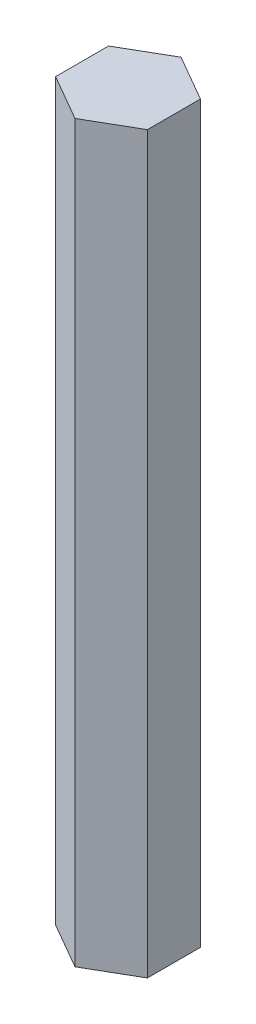
ISO-10303-21;
HEADER;
FILE_DESCRIPTION(('STEP AP214'),'2;1');
FILE_NAME('part.step','',(''),(''),'','','');
FILE_SCHEMA(('AUTOMOTIVE_DESIGN { 1 0 10303 214 1 1 1 1 }'));
ENDSEC;
DATA;
#1=APPLICATION_CONTEXT('core data for automotive mechanical design processes');
#2=APPLICATION_PROTOCOL_DEFINITION('international standard','automotive_design',2000,#1);
#3=PRODUCT_CONTEXT('',#1,'mechanical');
#4=PRODUCT('Part','Part','',(#3));
#5=PRODUCT_RELATED_PRODUCT_CATEGORY('part','',(#4));
#6=PRODUCT_DEFINITION_FORMATION('','',#4);
#7=PRODUCT_DEFINITION_CONTEXT('part definition',#1,'design');
#8=PRODUCT_DEFINITION('design','',#6,#7);
#9=PRODUCT_DEFINITION_SHAPE('','',#8);
#10=(LENGTH_UNIT() NAMED_UNIT(*) SI_UNIT(.MILLI.,.METRE.));
#11=(NAMED_UNIT(*) PLANE_ANGLE_UNIT() SI_UNIT($,.RADIAN.));
#12=(NAMED_UNIT(*) SI_UNIT($,.STERADIAN.) SOLID_ANGLE_UNIT());
#13=UNCERTAINTY_MEASURE_WITH_UNIT(LENGTH_MEASURE(1.E-05),#10,'distance_accuracy_value','');
#14=(GEOMETRIC_REPRESENTATION_CONTEXT(3) GLOBAL_UNCERTAINTY_ASSIGNED_CONTEXT((#13)) GLOBAL_UNIT_ASSIGNED_CONTEXT((#10,
#11,#12)) REPRESENTATION_CONTEXT('',''));
#15=CARTESIAN_POINT('',(0.,0.,0.));
#16=DIRECTION('',(0.,0.,1.));
#17=DIRECTION('',(1.,0.,0.));
#18=AXIS2_PLACEMENT_3D('',#15,#16,#17);
#19=CARTESIAN_POINT('',(4.99999999999996,80.,-2.88675134594818));
#20=DIRECTION('',(-0.499999999999995,0.,0.866025403784442));
#21=DIRECTION('',(0.866025403784442,0.,0.499999999999995));
#22=AXIS2_PLACEMENT_3D('',#19,#20,#21);
#23=PLANE('',#22);
#24=DIRECTION('',(-0.866025403784441,0.,-0.499999999999995));
#25=VECTOR('',#24,1.);
#26=CARTESIAN_POINT('',(4.99999999999996,0.,-2.88675134594818));
#27=LINE('',#26,#25);
#28=CARTESIAN_POINT('',(4.99999999999996,0.,-2.88675134594818));
#29=VERTEX_POINT('',#28);
#30=CARTESIAN_POINT('',(0.,0.,-5.77350269189625));
#31=VERTEX_POINT('',#30);
#32=EDGE_CURVE('E116',#29,#31,#27,.T.);
#33=ORIENTED_EDGE('',*,*,#32,.T.);
#34=DIRECTION('',(0.,-1.,0.));
#35=VECTOR('',#34,1.);
#36=CARTESIAN_POINT('',(0.,80.,-5.77350269189625));
#37=LINE('',#36,#35);
#38=CARTESIAN_POINT('',(0.,80.,-5.77350269189625));
#39=VERTEX_POINT('',#38);
#40=EDGE_CURVE('E11',#39,#31,#37,.T.);
#41=ORIENTED_EDGE('',*,*,#40,.F.);
#42=DIRECTION('',(-0.866025403784441,0.,-0.499999999999995));
#43=VECTOR('',#42,1.);
#44=CARTESIAN_POINT('',(4.99999999999996,80.,-2.88675134594818));
#45=LINE('',#44,#43);
#46=CARTESIAN_POINT('',(4.99999999999996,80.,-2.88675134594818));
#47=VERTEX_POINT('',#46);
#48=EDGE_CURVE('E127',#47,#39,#45,.T.);
#49=ORIENTED_EDGE('',*,*,#48,.F.);
#50=DIRECTION('',(0.,-1.,0.));
#51=VECTOR('',#50,1.);
#52=CARTESIAN_POINT('',(4.99999999999996,80.,-2.88675134594818));
#53=LINE('',#52,#51);
#54=EDGE_CURVE('E112',#47,#29,#53,.T.);
#55=ORIENTED_EDGE('',*,*,#54,.T.);
#56=EDGE_LOOP('',(#33,#41,#49,#55));
#57=FACE_BOUND('',#56,.T.);
#58=ADVANCED_FACE('F32',(#57),#23,.F.);
#59=CARTESIAN_POINT('',(0.,80.,-5.77350269189625));
#60=DIRECTION('',(0.500000000000001,0.,0.866025403784438));
#61=DIRECTION('',(0.866025403784438,0.,-0.500000000000001));
#62=AXIS2_PLACEMENT_3D('',#59,#60,#61);
#63=PLANE('',#62);
#64=DIRECTION('',(-0.866025403784438,0.,0.500000000000001));
#65=VECTOR('',#64,1.);
#66=CARTESIAN_POINT('',(0.,0.,-5.77350269189625));
#67=LINE('',#66,#65);
#68=CARTESIAN_POINT('',(-5.,0.,-2.88675134594811));
#69=VERTEX_POINT('',#68);
#70=EDGE_CURVE('E119',#31,#69,#67,.T.);
#71=ORIENTED_EDGE('',*,*,#70,.T.);
#72=DIRECTION('',(0.,-1.,0.));
#73=VECTOR('',#72,1.);
#74=CARTESIAN_POINT('',(-5.,80.,-2.88675134594811));
#75=LINE('',#74,#73);
#76=CARTESIAN_POINT('',(-5.,80.,-2.88675134594811));
#77=VERTEX_POINT('',#76);
#78=EDGE_CURVE('E40',#77,#69,#75,.T.);
#79=ORIENTED_EDGE('',*,*,#78,.F.);
#80=DIRECTION('',(-0.866025403784438,0.,0.500000000000001));
#81=VECTOR('',#80,1.);
#82=CARTESIAN_POINT('',(0.,80.,-5.77350269189625));
#83=LINE('',#82,#81);
#84=EDGE_CURVE('E85',#39,#77,#83,.T.);
#85=ORIENTED_EDGE('',*,*,#84,.F.);
#86=ORIENTED_EDGE('',*,*,#40,.T.);
#87=EDGE_LOOP('',(#71,#79,#85,#86));
#88=FACE_BOUND('',#87,.T.);
#89=ADVANCED_FACE('F151',(#88),#63,.F.);
#90=CARTESIAN_POINT('',(-5.,80.,-2.88675134594811));
#91=DIRECTION('',(1.,0.,0.));
#92=DIRECTION('',(0.,0.,-1.));
#93=AXIS2_PLACEMENT_3D('',#90,#91,#92);
#94=PLANE('',#93);
#95=DIRECTION('',(0.,0.,1.));
#96=VECTOR('',#95,1.);
#97=CARTESIAN_POINT('',(-5.,0.,-2.88675134594811));
#98=LINE('',#97,#96);
#99=CARTESIAN_POINT('',(-4.99999999999998,0.,2.88675134594815));
#100=VERTEX_POINT('',#99);
#101=EDGE_CURVE('E122',#69,#100,#98,.T.);
#102=ORIENTED_EDGE('',*,*,#101,.T.);
#103=DIRECTION('',(0.,-1.,0.));
#104=VECTOR('',#103,1.);
#105=CARTESIAN_POINT('',(-4.99999999999998,80.,2.88675134594815));
#106=LINE('',#105,#104);
#107=CARTESIAN_POINT('',(-4.99999999999998,80.,2.88675134594815));
#108=VERTEX_POINT('',#107);
#109=EDGE_CURVE('E107',#108,#100,#106,.T.);
#110=ORIENTED_EDGE('',*,*,#109,.F.);
#111=DIRECTION('',(0.,0.,1.));
#112=VECTOR('',#111,1.);
#113=CARTESIAN_POINT('',(-5.,80.,-2.88675134594811));
#114=LINE('',#113,#112);
#115=EDGE_CURVE('E98',#77,#108,#114,.T.);
#116=ORIENTED_EDGE('',*,*,#115,.F.);
#117=ORIENTED_EDGE('',*,*,#78,.T.);
#118=EDGE_LOOP('',(#102,#110,#116,#117));
#119=FACE_BOUND('',#118,.T.);
#120=ADVANCED_FACE('F133',(#119),#94,.F.);
#121=CARTESIAN_POINT('',(-4.99999999999998,80.,2.88675134594815));
#122=DIRECTION('',(0.499999999999995,0.,-0.866025403784442));
#123=DIRECTION('',(-0.866025403784442,0.,-0.499999999999995));
#124=AXIS2_PLACEMENT_3D('',#121,#122,#123);
#125=PLANE('',#124);
#126=DIRECTION('',(0.866025403784441,0.,0.499999999999995));
#127=VECTOR('',#126,1.);
#128=CARTESIAN_POINT('',(-4.99999999999998,0.,2.88675134594815));
#129=LINE('',#128,#127);
#130=CARTESIAN_POINT('',(0.,0.,5.77350269189625));
#131=VERTEX_POINT('',#130);
#132=EDGE_CURVE('E106',#100,#131,#129,.T.);
#133=ORIENTED_EDGE('',*,*,#132,.T.);
#134=DIRECTION('',(0.,-1.,0.));
#135=VECTOR('',#134,1.);
#136=CARTESIAN_POINT('',(0.,80.,5.77350269189625));
#137=LINE('',#136,#135);
#138=CARTESIAN_POINT('',(0.,80.,5.77350269189625));
#139=VERTEX_POINT('',#138);
#140=EDGE_CURVE('E103',#139,#131,#137,.T.);
#141=ORIENTED_EDGE('',*,*,#140,.F.);
#142=DIRECTION('',(0.866025403784441,0.,0.499999999999995));
#143=VECTOR('',#142,1.);
#144=CARTESIAN_POINT('',(-4.99999999999998,80.,2.88675134594815));
#145=LINE('',#144,#143);
#146=EDGE_CURVE('E92',#108,#139,#145,.T.);
#147=ORIENTED_EDGE('',*,*,#146,.F.);
#148=ORIENTED_EDGE('',*,*,#109,.T.);
#149=EDGE_LOOP('',(#133,#141,#147,#148));
#150=FACE_BOUND('',#149,.T.);
#151=ADVANCED_FACE('F104',(#150),#125,.F.);
#152=CARTESIAN_POINT('',(0.,80.,5.77350269189625));
#153=DIRECTION('',(-0.500000000000007,0.,-0.866025403784435));
#154=DIRECTION('',(-0.866025403784435,0.,0.500000000000007));
#155=AXIS2_PLACEMENT_3D('',#152,#153,#154);
#156=PLANE('',#155);
#157=DIRECTION('',(0.866025403784435,0.,-0.500000000000007));
#158=VECTOR('',#157,1.);
#159=CARTESIAN_POINT('',(0.,0.,5.77350269189625));
#160=LINE('',#159,#158);
#161=CARTESIAN_POINT('',(5.00000000000002,0.,2.88675134594808));
#162=VERTEX_POINT('',#161);
#163=EDGE_CURVE('E71',#131,#162,#160,.T.);
#164=ORIENTED_EDGE('',*,*,#163,.T.);
#165=DIRECTION('',(0.,-1.,0.));
#166=VECTOR('',#165,1.);
#167=CARTESIAN_POINT('',(5.00000000000002,80.,2.88675134594808));
#168=LINE('',#167,#166);
#169=CARTESIAN_POINT('',(5.00000000000002,80.,2.88675134594808));
#170=VERTEX_POINT('',#169);
#171=EDGE_CURVE('E108',#170,#162,#168,.T.);
#172=ORIENTED_EDGE('',*,*,#171,.F.);
#173=DIRECTION('',(0.866025403784435,0.,-0.500000000000007));
#174=VECTOR('',#173,1.);
#175=CARTESIAN_POINT('',(0.,80.,5.77350269189625));
#176=LINE('',#175,#174);
#177=EDGE_CURVE('E96',#139,#170,#176,.T.);
#178=ORIENTED_EDGE('',*,*,#177,.F.);
#179=ORIENTED_EDGE('',*,*,#140,.T.);
#180=EDGE_LOOP('',(#164,#172,#178,#179));
#181=FACE_BOUND('',#180,.T.);
#182=ADVANCED_FACE('F110',(#181),#156,.F.);
#183=CARTESIAN_POINT('',(5.00000000000002,80.,2.88675134594808));
#184=DIRECTION('',(-1.,0.,0.));
#185=DIRECTION('',(0.,0.,1.));
#186=AXIS2_PLACEMENT_3D('',#183,#184,#185);
#187=PLANE('',#186);
#188=DIRECTION('',(0.,0.,-1.));
#189=VECTOR('',#188,1.);
#190=CARTESIAN_POINT('',(5.00000000000002,0.,2.88675134594808));
#191=LINE('',#190,#189);
#192=EDGE_CURVE('E77',#162,#29,#191,.T.);
#193=ORIENTED_EDGE('',*,*,#192,.T.);
#194=ORIENTED_EDGE('',*,*,#54,.F.);
#195=DIRECTION('',(0.,0.,-1.));
#196=VECTOR('',#195,1.);
#197=CARTESIAN_POINT('',(5.00000000000002,80.,2.88675134594808));
#198=LINE('',#197,#196);
#199=EDGE_CURVE('E48',#170,#47,#198,.T.);
#200=ORIENTED_EDGE('',*,*,#199,.F.);
#201=ORIENTED_EDGE('',*,*,#171,.T.);
#202=EDGE_LOOP('',(#193,#194,#200,#201));
#203=FACE_BOUND('',#202,.T.);
#204=ADVANCED_FACE('F140',(#203),#187,.F.);
#205=CARTESIAN_POINT('',(0.,80.,0.));
#206=DIRECTION('',(0.,1.,0.));
#207=DIRECTION('',(0.,0.,1.));
#208=AXIS2_PLACEMENT_3D('',#205,#206,#207);
#209=PLANE('',#208);
#210=ORIENTED_EDGE('',*,*,#48,.T.);
#211=ORIENTED_EDGE('',*,*,#84,.T.);
#212=ORIENTED_EDGE('',*,*,#115,.T.);
#213=ORIENTED_EDGE('',*,*,#146,.T.);
#214=ORIENTED_EDGE('',*,*,#177,.T.);
#215=ORIENTED_EDGE('',*,*,#199,.T.);
#216=EDGE_LOOP('',(#210,#211,#212,#213,#214,#215));
#217=FACE_BOUND('',#216,.T.);
#218=ADVANCED_FACE('F94',(#217),#209,.T.);
#219=CARTESIAN_POINT('',(0.,0.,0.));
#220=DIRECTION('',(0.,1.,0.));
#221=DIRECTION('',(0.,0.,1.));
#222=AXIS2_PLACEMENT_3D('',#219,#220,#221);
#223=PLANE('',#222);
#224=CARTESIAN_POINT('',(0.,0.,0.));
#225=DIRECTION('',(0.,-1.,0.));
#226=DIRECTION('',(0.,0.,-1.));
#227=AXIS2_PLACEMENT_3D('',#224,#225,#226);
#228=CIRCLE('',#227,3.);
#229=CARTESIAN_POINT('',(0.,0.,-3.));
#230=VERTEX_POINT('',#229);
#231=EDGE_CURVE('E213',#230,#230,#228,.T.);
#232=ORIENTED_EDGE('',*,*,#231,.F.);
#233=EDGE_LOOP('',(#232));
#234=FACE_BOUND('',#233,.T.);
#235=ORIENTED_EDGE('',*,*,#32,.F.);
#236=ORIENTED_EDGE('',*,*,#192,.F.);
#237=ORIENTED_EDGE('',*,*,#163,.F.);
#238=ORIENTED_EDGE('',*,*,#132,.F.);
#239=ORIENTED_EDGE('',*,*,#101,.F.);
#240=ORIENTED_EDGE('',*,*,#70,.F.);
#241=EDGE_LOOP('',(#235,#236,#237,#238,#239,#240));
#242=FACE_BOUND('',#241,.T.);
#243=ADVANCED_FACE('F136',(#234,#242),#223,.F.);
#244=CARTESIAN_POINT('',(0.,5.,0.));
#245=DIRECTION('',(0.,-1.,0.));
#246=DIRECTION('',(0.,0.,-1.));
#247=AXIS2_PLACEMENT_3D('',#244,#245,#246);
#248=CYLINDRICAL_SURFACE('',#247,3.);
#249=CARTESIAN_POINT('',(0.,5.,0.));
#250=DIRECTION('',(0.,-1.,0.));
#251=DIRECTION('',(0.,0.,-1.));
#252=AXIS2_PLACEMENT_3D('',#249,#250,#251);
#253=CIRCLE('',#252,3.);
#254=CARTESIAN_POINT('',(0.,5.,-3.));
#255=VERTEX_POINT('',#254);
#256=EDGE_CURVE('E120',#255,#255,#253,.T.);
#257=ORIENTED_EDGE('',*,*,#256,.F.);
#258=EDGE_LOOP('',(#257));
#259=FACE_BOUND('',#258,.T.);
#260=ORIENTED_EDGE('',*,*,#231,.T.);
#261=EDGE_LOOP('',(#260));
#262=FACE_BOUND('',#261,.T.);
#263=ADVANCED_FACE('F188',(#259,#262),#248,.F.);
#264=CARTESIAN_POINT('',(0.,5.,0.));
#265=DIRECTION('',(0.,-1.,0.));
#266=DIRECTION('',(0.,0.,-1.));
#267=AXIS2_PLACEMENT_3D('',#264,#265,#266);
#268=PLANE('',#267);
#269=ORIENTED_EDGE('',*,*,#256,.T.);
#270=EDGE_LOOP('',(#269));
#271=FACE_BOUND('',#270,.T.);
#272=ADVANCED_FACE('F197',(#271),#268,.T.);
#273=CLOSED_SHELL('',(#58,#89,#120,#151,#182,#204,#218,#243,#263,#272));
#274=MANIFOLD_SOLID_BREP('B2',#273);
#275=ADVANCED_BREP_SHAPE_REPRESENTATION('',(#18,#274),#14);
#276=SHAPE_DEFINITION_REPRESENTATION(#9,#275);
ENDSEC;
END-ISO-10303-21;
